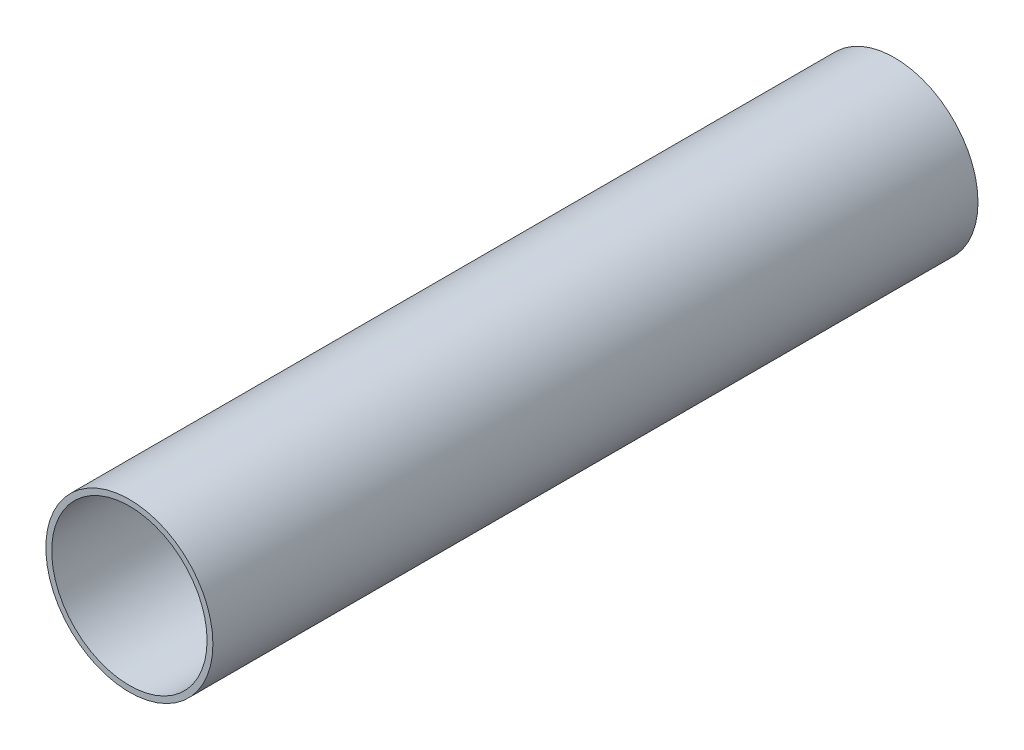
ISO-10303-21;
HEADER;
FILE_DESCRIPTION(('STEP AP214'),'2;1');
FILE_NAME('part.step','',(''),(''),'','','');
FILE_SCHEMA(('AUTOMOTIVE_DESIGN { 1 0 10303 214 1 1 1 1 }'));
ENDSEC;
DATA;
#1=APPLICATION_CONTEXT('core data for automotive mechanical design processes');
#2=APPLICATION_PROTOCOL_DEFINITION('international standard','automotive_design',2000,#1);
#3=PRODUCT_CONTEXT('',#1,'mechanical');
#4=PRODUCT('Part','Part','',(#3));
#5=PRODUCT_RELATED_PRODUCT_CATEGORY('part','',(#4));
#6=PRODUCT_DEFINITION_FORMATION('','',#4);
#7=PRODUCT_DEFINITION_CONTEXT('part definition',#1,'design');
#8=PRODUCT_DEFINITION('design','',#6,#7);
#9=PRODUCT_DEFINITION_SHAPE('','',#8);
#10=(LENGTH_UNIT() NAMED_UNIT(*) SI_UNIT(.MILLI.,.METRE.));
#11=(NAMED_UNIT(*) PLANE_ANGLE_UNIT() SI_UNIT($,.RADIAN.));
#12=(NAMED_UNIT(*) SI_UNIT($,.STERADIAN.) SOLID_ANGLE_UNIT());
#13=UNCERTAINTY_MEASURE_WITH_UNIT(LENGTH_MEASURE(1.E-05),#10,'distance_accuracy_value','');
#14=(GEOMETRIC_REPRESENTATION_CONTEXT(3) GLOBAL_UNCERTAINTY_ASSIGNED_CONTEXT((#13)) GLOBAL_UNIT_ASSIGNED_CONTEXT((#10,
#11,#12)) REPRESENTATION_CONTEXT('',''));
#15=CARTESIAN_POINT('',(0.,0.,0.));
#16=DIRECTION('',(0.,0.,1.));
#17=DIRECTION('',(1.,0.,0.));
#18=AXIS2_PLACEMENT_3D('',#15,#16,#17);
#19=CARTESIAN_POINT('',(0.,0.,203.2));
#20=DIRECTION('',(0.,0.,1.));
#21=DIRECTION('',(1.,0.,0.));
#22=AXIS2_PLACEMENT_3D('',#19,#20,#21);
#23=PLANE('',#22);
#24=CARTESIAN_POINT('',(0.,0.,203.2));
#25=DIRECTION('',(0.,0.,1.));
#26=DIRECTION('',(1.,0.,0.));
#27=AXIS2_PLACEMENT_3D('',#24,#25,#26);
#28=CIRCLE('',#27,22.1869);
#29=CARTESIAN_POINT('',(22.1869,0.,203.2));
#30=VERTEX_POINT('',#29);
#31=EDGE_CURVE('E10',#30,#30,#28,.T.);
#32=ORIENTED_EDGE('',*,*,#31,.T.);
#33=EDGE_LOOP('',(#32));
#34=FACE_BOUND('',#33,.T.);
#35=CARTESIAN_POINT('',(0.,0.,203.2));
#36=DIRECTION('',(0.,0.,1.));
#37=DIRECTION('',(1.,0.,0.));
#38=AXIS2_PLACEMENT_3D('',#35,#36,#37);
#39=CIRCLE('',#38,20.6375);
#40=CARTESIAN_POINT('',(20.6375,0.,203.2));
#41=VERTEX_POINT('',#40);
#42=EDGE_CURVE('E42',#41,#41,#39,.T.);
#43=ORIENTED_EDGE('',*,*,#42,.F.);
#44=EDGE_LOOP('',(#43));
#45=FACE_BOUND('',#44,.T.);
#46=ADVANCED_FACE('F31',(#34,#45),#23,.T.);
#47=CARTESIAN_POINT('',(0.,0.,0.));
#48=DIRECTION('',(0.,0.,1.));
#49=DIRECTION('',(1.,0.,0.));
#50=AXIS2_PLACEMENT_3D('',#47,#48,#49);
#51=PLANE('',#50);
#52=CARTESIAN_POINT('',(0.,0.,0.));
#53=DIRECTION('',(0.,0.,1.));
#54=DIRECTION('',(1.,0.,0.));
#55=AXIS2_PLACEMENT_3D('',#52,#53,#54);
#56=CIRCLE('',#55,22.1869);
#57=CARTESIAN_POINT('',(22.1869,0.,0.));
#58=VERTEX_POINT('',#57);
#59=EDGE_CURVE('E35',#58,#58,#56,.T.);
#60=ORIENTED_EDGE('',*,*,#59,.F.);
#61=EDGE_LOOP('',(#60));
#62=FACE_BOUND('',#61,.T.);
#63=CARTESIAN_POINT('',(0.,0.,0.));
#64=DIRECTION('',(0.,0.,1.));
#65=DIRECTION('',(1.,0.,0.));
#66=AXIS2_PLACEMENT_3D('',#63,#64,#65);
#67=CIRCLE('',#66,20.6375);
#68=CARTESIAN_POINT('',(20.6375,0.,0.));
#69=VERTEX_POINT('',#68);
#70=EDGE_CURVE('E44',#69,#69,#67,.T.);
#71=ORIENTED_EDGE('',*,*,#70,.T.);
#72=EDGE_LOOP('',(#71));
#73=FACE_BOUND('',#72,.T.);
#74=ADVANCED_FACE('F54',(#62,#73),#51,.F.);
#75=CARTESIAN_POINT('',(0.,0.,203.2));
#76=DIRECTION('',(0.,0.,-1.));
#77=DIRECTION('',(-1.,0.,0.));
#78=AXIS2_PLACEMENT_3D('',#75,#76,#77);
#79=CYLINDRICAL_SURFACE('',#78,22.1869);
#80=ORIENTED_EDGE('',*,*,#31,.F.);
#81=EDGE_LOOP('',(#80));
#82=FACE_BOUND('',#81,.T.);
#83=ORIENTED_EDGE('',*,*,#59,.T.);
#84=EDGE_LOOP('',(#83));
#85=FACE_BOUND('',#84,.T.);
#86=ADVANCED_FACE('F33',(#82,#85),#79,.T.);
#87=CARTESIAN_POINT('',(0.,0.,203.2));
#88=DIRECTION('',(0.,0.,-1.));
#89=DIRECTION('',(-1.,0.,0.));
#90=AXIS2_PLACEMENT_3D('',#87,#88,#89);
#91=CYLINDRICAL_SURFACE('',#90,20.6375);
#92=ORIENTED_EDGE('',*,*,#42,.T.);
#93=EDGE_LOOP('',(#92));
#94=FACE_BOUND('',#93,.T.);
#95=ORIENTED_EDGE('',*,*,#70,.F.);
#96=EDGE_LOOP('',(#95));
#97=FACE_BOUND('',#96,.T.);
#98=ADVANCED_FACE('F50',(#94,#97),#91,.F.);
#99=CLOSED_SHELL('',(#46,#74,#86,#98));
#100=MANIFOLD_SOLID_BREP('B2',#99);
#101=ADVANCED_BREP_SHAPE_REPRESENTATION('',(#18,#100),#14);
#102=SHAPE_DEFINITION_REPRESENTATION(#9,#101);
ENDSEC;
END-ISO-10303-21;
